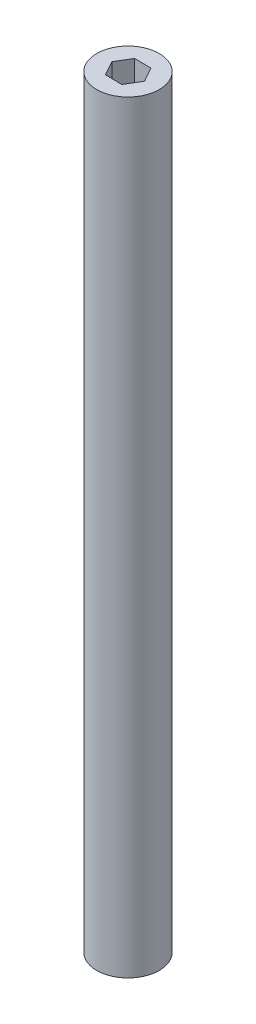
ISO-10303-21;
HEADER;
FILE_DESCRIPTION(('STEP AP214'),'2;1');
FILE_NAME('part.step','',(''),(''),'','','');
FILE_SCHEMA(('AUTOMOTIVE_DESIGN { 1 0 10303 214 1 1 1 1 }'));
ENDSEC;
DATA;
#1=APPLICATION_CONTEXT('core data for automotive mechanical design processes');
#2=APPLICATION_PROTOCOL_DEFINITION('international standard','automotive_design',2000,#1);
#3=PRODUCT_CONTEXT('',#1,'mechanical');
#4=PRODUCT('Part','Part','',(#3));
#5=PRODUCT_RELATED_PRODUCT_CATEGORY('part','',(#4));
#6=PRODUCT_DEFINITION_FORMATION('','',#4);
#7=PRODUCT_DEFINITION_CONTEXT('part definition',#1,'design');
#8=PRODUCT_DEFINITION('design','',#6,#7);
#9=PRODUCT_DEFINITION_SHAPE('','',#8);
#10=(LENGTH_UNIT() NAMED_UNIT(*) SI_UNIT(.MILLI.,.METRE.));
#11=(NAMED_UNIT(*) PLANE_ANGLE_UNIT() SI_UNIT($,.RADIAN.));
#12=(NAMED_UNIT(*) SI_UNIT($,.STERADIAN.) SOLID_ANGLE_UNIT());
#13=UNCERTAINTY_MEASURE_WITH_UNIT(LENGTH_MEASURE(1.E-05),#10,'distance_accuracy_value','');
#14=(GEOMETRIC_REPRESENTATION_CONTEXT(3) GLOBAL_UNCERTAINTY_ASSIGNED_CONTEXT((#13)) GLOBAL_UNIT_ASSIGNED_CONTEXT((#10,
#11,#12)) REPRESENTATION_CONTEXT('',''));
#15=CARTESIAN_POINT('',(0.,0.,0.));
#16=DIRECTION('',(0.,0.,1.));
#17=DIRECTION('',(1.,0.,0.));
#18=AXIS2_PLACEMENT_3D('',#15,#16,#17);
#19=CARTESIAN_POINT('',(0.,309.88,0.));
#20=DIRECTION('',(0.,1.,0.));
#21=DIRECTION('',(0.,0.,1.));
#22=AXIS2_PLACEMENT_3D('',#19,#20,#21);
#23=PLANE('',#22);
#24=CARTESIAN_POINT('',(0.,309.88,0.));
#25=DIRECTION('',(0.,1.,0.));
#26=DIRECTION('',(0.,0.,1.));
#27=AXIS2_PLACEMENT_3D('',#24,#25,#26);
#28=CIRCLE('',#27,12.6980484885272);
#29=CARTESIAN_POINT('',(0.,309.88,12.6980484885272));
#30=VERTEX_POINT('',#29);
#31=EDGE_CURVE('E11',#30,#30,#28,.T.);
#32=ORIENTED_EDGE('',*,*,#31,.T.);
#33=EDGE_LOOP('',(#32));
#34=FACE_BOUND('',#33,.T.);
#35=DIRECTION('',(0.514220942434934,0.,-0.857657753629808));
#36=VECTOR('',#35,1.);
#37=CARTESIAN_POINT('',(3.29660292305689,309.88,5.8305790369239));
#38=LINE('',#37,#36);
#39=CARTESIAN_POINT('',(3.29660292305689,309.88,5.8305790369239));
#40=VERTEX_POINT('',#39);
#41=CARTESIAN_POINT('',(6.76566081374914,309.88,0.0446139930763466));
#42=VERTEX_POINT('',#41);
#43=EDGE_CURVE('E102',#40,#42,#38,.T.);
#44=ORIENTED_EDGE('',*,*,#43,.F.);
#45=DIRECTION('',(0.999863873613576,0.,0.0164995224917249));
#46=VECTOR('',#45,1.);
#47=CARTESIAN_POINT('',(-3.44871873566995,309.88,5.71926929830932));
#48=LINE('',#47,#46);
#49=CARTESIAN_POINT('',(-3.44871873566995,309.88,5.71926929830932));
#50=VERTEX_POINT('',#49);
#51=EDGE_CURVE('E93',#50,#40,#48,.T.);
#52=ORIENTED_EDGE('',*,*,#51,.F.);
#53=DIRECTION('',(0.485642931178642,0.,0.874157276121532));
#54=VECTOR('',#53,1.);
#55=CARTESIAN_POINT('',(-6.72498250370455,309.88,-0.178005484152799));
#56=LINE('',#55,#54);
#57=CARTESIAN_POINT('',(-6.72498250370455,309.88,-0.178005484152799));
#58=VERTEX_POINT('',#57);
#59=EDGE_CURVE('E127',#58,#50,#56,.T.);
#60=ORIENTED_EDGE('',*,*,#59,.F.);
#61=DIRECTION('',(-0.514220942434934,0.,0.857657753629808));
#62=VECTOR('',#61,1.);
#63=CARTESIAN_POINT('',(-3.2559246130123,309.88,-5.96397052800035));
#64=LINE('',#63,#62);
#65=CARTESIAN_POINT('',(-3.2559246130123,309.88,-5.96397052800035));
#66=VERTEX_POINT('',#65);
#67=EDGE_CURVE('E124',#66,#58,#64,.T.);
#68=ORIENTED_EDGE('',*,*,#67,.F.);
#69=DIRECTION('',(-0.999863873613576,0.,-0.016499522491725));
#70=VECTOR('',#69,1.);
#71=CARTESIAN_POINT('',(3.48939704571454,309.88,-5.85266078938578));
#72=LINE('',#71,#70);
#73=CARTESIAN_POINT('',(3.48939704571454,309.88,-5.85266078938578));
#74=VERTEX_POINT('',#73);
#75=EDGE_CURVE('E119',#74,#66,#72,.T.);
#76=ORIENTED_EDGE('',*,*,#75,.F.);
#77=DIRECTION('',(-0.485642931178642,0.,-0.874157276121532));
#78=VECTOR('',#77,1.);
#79=CARTESIAN_POINT('',(6.76566081374914,309.88,0.0446139930763466));
#80=LINE('',#79,#78);
#81=EDGE_CURVE('E115',#42,#74,#80,.T.);
#82=ORIENTED_EDGE('',*,*,#81,.F.);
#83=EDGE_LOOP('',(#44,#52,#60,#68,#76,#82));
#84=FACE_BOUND('',#83,.T.);
#85=ADVANCED_FACE('F39',(#34,#84),#23,.T.);
#86=CARTESIAN_POINT('',(0.,0.,0.));
#87=DIRECTION('',(0.,1.,0.));
#88=DIRECTION('',(0.,0.,1.));
#89=AXIS2_PLACEMENT_3D('',#86,#87,#88);
#90=PLANE('',#89);
#91=CARTESIAN_POINT('',(0.,0.,0.));
#92=DIRECTION('',(0.,1.,0.));
#93=DIRECTION('',(0.,0.,1.));
#94=AXIS2_PLACEMENT_3D('',#91,#92,#93);
#95=CIRCLE('',#94,12.6980484885272);
#96=CARTESIAN_POINT('',(0.,0.,12.6980484885272));
#97=VERTEX_POINT('',#96);
#98=EDGE_CURVE('E43',#97,#97,#95,.T.);
#99=ORIENTED_EDGE('',*,*,#98,.F.);
#100=EDGE_LOOP('',(#99));
#101=FACE_BOUND('',#100,.T.);
#102=DIRECTION('',(0.999863873613576,0.,0.0164995224917249));
#103=VECTOR('',#102,1.);
#104=CARTESIAN_POINT('',(-3.44871873566995,0.,5.71926929830932));
#105=LINE('',#104,#103);
#106=CARTESIAN_POINT('',(-3.44871873566995,0.,5.71926929830932));
#107=VERTEX_POINT('',#106);
#108=CARTESIAN_POINT('',(3.29660292305689,0.,5.8305790369239));
#109=VERTEX_POINT('',#108);
#110=EDGE_CURVE('E63',#107,#109,#105,.T.);
#111=ORIENTED_EDGE('',*,*,#110,.T.);
#112=DIRECTION('',(0.514220942434934,0.,-0.857657753629808));
#113=VECTOR('',#112,1.);
#114=CARTESIAN_POINT('',(3.29660292305689,0.,5.8305790369239));
#115=LINE('',#114,#113);
#116=CARTESIAN_POINT('',(6.76566081374914,0.,0.0446139930763466));
#117=VERTEX_POINT('',#116);
#118=EDGE_CURVE('E109',#109,#117,#115,.T.);
#119=ORIENTED_EDGE('',*,*,#118,.T.);
#120=DIRECTION('',(-0.485642931178642,0.,-0.874157276121532));
#121=VECTOR('',#120,1.);
#122=CARTESIAN_POINT('',(6.76566081374914,0.,0.0446139930763466));
#123=LINE('',#122,#121);
#124=CARTESIAN_POINT('',(3.48939704571454,0.,-5.85266078938578));
#125=VERTEX_POINT('',#124);
#126=EDGE_CURVE('E134',#117,#125,#123,.T.);
#127=ORIENTED_EDGE('',*,*,#126,.T.);
#128=DIRECTION('',(-0.999863873613576,0.,-0.016499522491725));
#129=VECTOR('',#128,1.);
#130=CARTESIAN_POINT('',(3.48939704571454,0.,-5.85266078938578));
#131=LINE('',#130,#129);
#132=CARTESIAN_POINT('',(-3.2559246130123,0.,-5.96397052800035));
#133=VERTEX_POINT('',#132);
#134=EDGE_CURVE('E138',#125,#133,#131,.T.);
#135=ORIENTED_EDGE('',*,*,#134,.T.);
#136=DIRECTION('',(-0.514220942434934,0.,0.857657753629808));
#137=VECTOR('',#136,1.);
#138=CARTESIAN_POINT('',(-3.2559246130123,0.,-5.96397052800035));
#139=LINE('',#138,#137);
#140=CARTESIAN_POINT('',(-6.72498250370455,0.,-0.178005484152799));
#141=VERTEX_POINT('',#140);
#142=EDGE_CURVE('E142',#133,#141,#139,.T.);
#143=ORIENTED_EDGE('',*,*,#142,.T.);
#144=DIRECTION('',(0.485642931178642,0.,0.874157276121532));
#145=VECTOR('',#144,1.);
#146=CARTESIAN_POINT('',(-6.72498250370455,0.,-0.178005484152799));
#147=LINE('',#146,#145);
#148=EDGE_CURVE('E103',#141,#107,#147,.T.);
#149=ORIENTED_EDGE('',*,*,#148,.T.);
#150=EDGE_LOOP('',(#111,#119,#127,#135,#143,#149));
#151=FACE_BOUND('',#150,.T.);
#152=ADVANCED_FACE('F166',(#101,#151),#90,.F.);
#153=CARTESIAN_POINT('',(0.,309.88,0.));
#154=DIRECTION('',(0.,-1.,0.));
#155=DIRECTION('',(0.,0.,-1.));
#156=AXIS2_PLACEMENT_3D('',#153,#154,#155);
#157=CYLINDRICAL_SURFACE('',#156,12.6980484885272);
#158=ORIENTED_EDGE('',*,*,#31,.F.);
#159=EDGE_LOOP('',(#158));
#160=FACE_BOUND('',#159,.T.);
#161=ORIENTED_EDGE('',*,*,#98,.T.);
#162=EDGE_LOOP('',(#161));
#163=FACE_BOUND('',#162,.T.);
#164=ADVANCED_FACE('F41',(#160,#163),#157,.T.);
#165=CARTESIAN_POINT('',(-3.44871873566995,309.88,5.71926929830932));
#166=DIRECTION('',(0.0164995224917249,0.,-0.999863873613576));
#167=DIRECTION('',(-0.999863873613576,0.,-0.0164995224917249));
#168=AXIS2_PLACEMENT_3D('',#165,#166,#167);
#169=PLANE('',#168);
#170=ORIENTED_EDGE('',*,*,#110,.F.);
#171=DIRECTION('',(0.,-1.,0.));
#172=VECTOR('',#171,1.);
#173=CARTESIAN_POINT('',(-3.44871873566995,309.88,5.71926929830932));
#174=LINE('',#173,#172);
#175=EDGE_CURVE('E97',#50,#107,#174,.T.);
#176=ORIENTED_EDGE('',*,*,#175,.F.);
#177=ORIENTED_EDGE('',*,*,#51,.T.);
#178=DIRECTION('',(0.,-1.,0.));
#179=VECTOR('',#178,1.);
#180=CARTESIAN_POINT('',(3.29660292305689,309.88,5.8305790369239));
#181=LINE('',#180,#179);
#182=EDGE_CURVE('E96',#40,#109,#181,.T.);
#183=ORIENTED_EDGE('',*,*,#182,.T.);
#184=EDGE_LOOP('',(#170,#176,#177,#183));
#185=FACE_BOUND('',#184,.T.);
#186=ADVANCED_FACE('F95',(#185),#169,.T.);
#187=CARTESIAN_POINT('',(3.29660292305689,309.88,5.8305790369239));
#188=DIRECTION('',(-0.857657753629808,0.,-0.514220942434934));
#189=DIRECTION('',(-0.514220942434934,0.,0.857657753629808));
#190=AXIS2_PLACEMENT_3D('',#187,#188,#189);
#191=PLANE('',#190);
#192=ORIENTED_EDGE('',*,*,#118,.F.);
#193=ORIENTED_EDGE('',*,*,#182,.F.);
#194=ORIENTED_EDGE('',*,*,#43,.T.);
#195=DIRECTION('',(0.,-1.,0.));
#196=VECTOR('',#195,1.);
#197=CARTESIAN_POINT('',(6.76566081374914,309.88,0.0446139930763466));
#198=LINE('',#197,#196);
#199=EDGE_CURVE('E111',#42,#117,#198,.T.);
#200=ORIENTED_EDGE('',*,*,#199,.T.);
#201=EDGE_LOOP('',(#192,#193,#194,#200));
#202=FACE_BOUND('',#201,.T.);
#203=ADVANCED_FACE('F106',(#202),#191,.T.);
#204=CARTESIAN_POINT('',(6.76566081374914,309.88,0.0446139930763466));
#205=DIRECTION('',(-0.874157276121532,0.,0.485642931178642));
#206=DIRECTION('',(0.485642931178642,0.,0.874157276121532));
#207=AXIS2_PLACEMENT_3D('',#204,#205,#206);
#208=PLANE('',#207);
#209=ORIENTED_EDGE('',*,*,#126,.F.);
#210=ORIENTED_EDGE('',*,*,#199,.F.);
#211=ORIENTED_EDGE('',*,*,#81,.T.);
#212=DIRECTION('',(0.,-1.,0.));
#213=VECTOR('',#212,1.);
#214=CARTESIAN_POINT('',(3.48939704571454,309.88,-5.85266078938578));
#215=LINE('',#214,#213);
#216=EDGE_CURVE('E156',#74,#125,#215,.T.);
#217=ORIENTED_EDGE('',*,*,#216,.T.);
#218=EDGE_LOOP('',(#209,#210,#211,#217));
#219=FACE_BOUND('',#218,.T.);
#220=ADVANCED_FACE('F162',(#219),#208,.T.);
#221=CARTESIAN_POINT('',(3.48939704571454,309.88,-5.85266078938578));
#222=DIRECTION('',(-0.016499522491725,0.,0.999863873613576));
#223=DIRECTION('',(0.999863873613576,0.,0.016499522491725));
#224=AXIS2_PLACEMENT_3D('',#221,#222,#223);
#225=PLANE('',#224);
#226=ORIENTED_EDGE('',*,*,#134,.F.);
#227=ORIENTED_EDGE('',*,*,#216,.F.);
#228=ORIENTED_EDGE('',*,*,#75,.T.);
#229=DIRECTION('',(0.,-1.,0.));
#230=VECTOR('',#229,1.);
#231=CARTESIAN_POINT('',(-3.2559246130123,309.88,-5.96397052800035));
#232=LINE('',#231,#230);
#233=EDGE_CURVE('E153',#66,#133,#232,.T.);
#234=ORIENTED_EDGE('',*,*,#233,.T.);
#235=EDGE_LOOP('',(#226,#227,#228,#234));
#236=FACE_BOUND('',#235,.T.);
#237=ADVANCED_FACE('F174',(#236),#225,.T.);
#238=CARTESIAN_POINT('',(-3.2559246130123,309.88,-5.96397052800035));
#239=DIRECTION('',(0.857657753629808,0.,0.514220942434934));
#240=DIRECTION('',(0.514220942434934,0.,-0.857657753629808));
#241=AXIS2_PLACEMENT_3D('',#238,#239,#240);
#242=PLANE('',#241);
#243=ORIENTED_EDGE('',*,*,#142,.F.);
#244=ORIENTED_EDGE('',*,*,#233,.F.);
#245=ORIENTED_EDGE('',*,*,#67,.T.);
#246=DIRECTION('',(0.,-1.,0.));
#247=VECTOR('',#246,1.);
#248=CARTESIAN_POINT('',(-6.72498250370455,309.88,-0.178005484152799));
#249=LINE('',#248,#247);
#250=EDGE_CURVE('E55',#58,#141,#249,.T.);
#251=ORIENTED_EDGE('',*,*,#250,.T.);
#252=EDGE_LOOP('',(#243,#244,#245,#251));
#253=FACE_BOUND('',#252,.T.);
#254=ADVANCED_FACE('F172',(#253),#242,.T.);
#255=CARTESIAN_POINT('',(-6.72498250370455,309.88,-0.178005484152799));
#256=DIRECTION('',(0.874157276121532,0.,-0.485642931178642));
#257=DIRECTION('',(-0.485642931178642,0.,-0.874157276121532));
#258=AXIS2_PLACEMENT_3D('',#255,#256,#257);
#259=PLANE('',#258);
#260=ORIENTED_EDGE('',*,*,#148,.F.);
#261=ORIENTED_EDGE('',*,*,#250,.F.);
#262=ORIENTED_EDGE('',*,*,#59,.T.);
#263=ORIENTED_EDGE('',*,*,#175,.T.);
#264=EDGE_LOOP('',(#260,#261,#262,#263));
#265=FACE_BOUND('',#264,.T.);
#266=ADVANCED_FACE('F168',(#265),#259,.T.);
#267=CLOSED_SHELL('',(#85,#152,#164,#186,#203,#220,#237,#254,#266));
#268=MANIFOLD_SOLID_BREP('B2',#267);
#269=ADVANCED_BREP_SHAPE_REPRESENTATION('',(#18,#268),#14);
#270=SHAPE_DEFINITION_REPRESENTATION(#9,#269);
ENDSEC;
END-ISO-10303-21;
